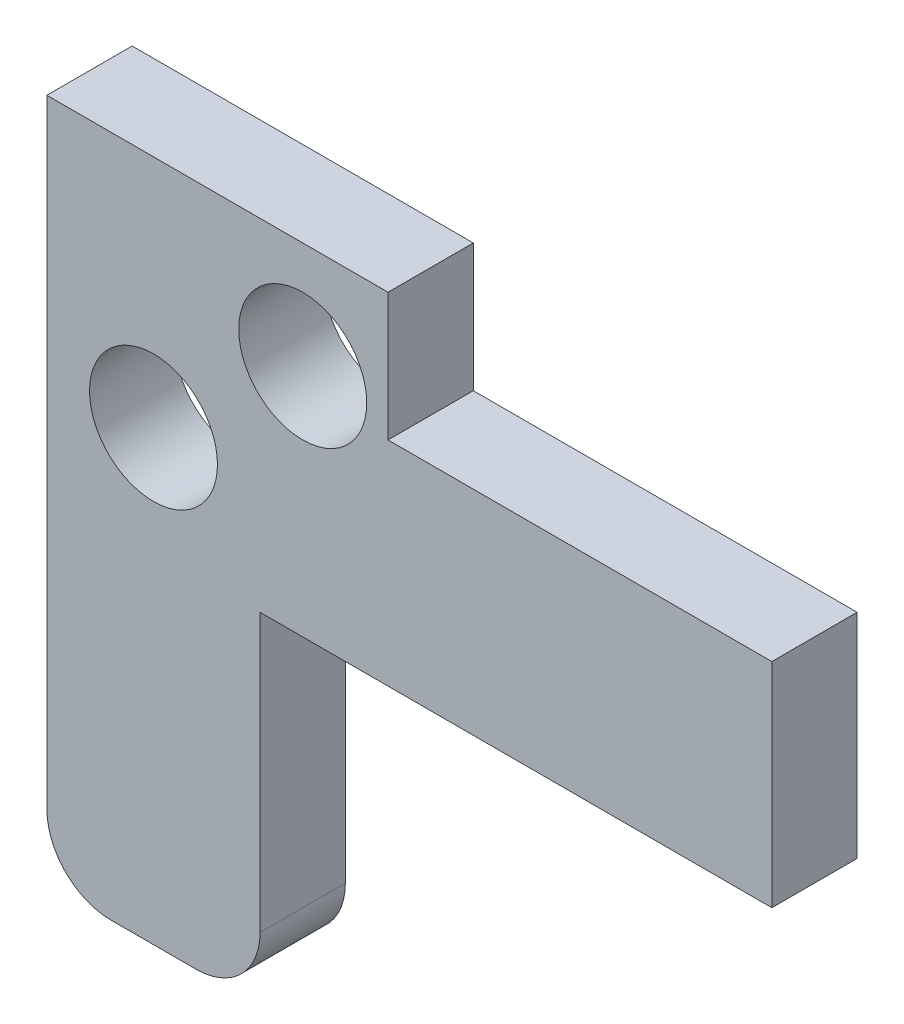
ISO-10303-21;
HEADER;
FILE_DESCRIPTION(('STEP AP214'),'2;1');
FILE_NAME('part.step','',(''),(''),'','','');
FILE_SCHEMA(('AUTOMOTIVE_DESIGN { 1 0 10303 214 1 1 1 1 }'));
ENDSEC;
DATA;
#1=APPLICATION_CONTEXT('core data for automotive mechanical design processes');
#2=APPLICATION_PROTOCOL_DEFINITION('international standard','automotive_design',2000,#1);
#3=PRODUCT_CONTEXT('',#1,'mechanical');
#4=PRODUCT('Part','Part','',(#3));
#5=PRODUCT_RELATED_PRODUCT_CATEGORY('part','',(#4));
#6=PRODUCT_DEFINITION_FORMATION('','',#4);
#7=PRODUCT_DEFINITION_CONTEXT('part definition',#1,'design');
#8=PRODUCT_DEFINITION('design','',#6,#7);
#9=PRODUCT_DEFINITION_SHAPE('','',#8);
#10=(LENGTH_UNIT() NAMED_UNIT(*) SI_UNIT(.MILLI.,.METRE.));
#11=(NAMED_UNIT(*) PLANE_ANGLE_UNIT() SI_UNIT($,.RADIAN.));
#12=(NAMED_UNIT(*) SI_UNIT($,.STERADIAN.) SOLID_ANGLE_UNIT());
#13=UNCERTAINTY_MEASURE_WITH_UNIT(LENGTH_MEASURE(1.E-05),#10,'distance_accuracy_value','');
#14=(GEOMETRIC_REPRESENTATION_CONTEXT(3) GLOBAL_UNCERTAINTY_ASSIGNED_CONTEXT((#13)) GLOBAL_UNIT_ASSIGNED_CONTEXT((#10,
#11,#12)) REPRESENTATION_CONTEXT('',''));
#15=CARTESIAN_POINT('',(0.,0.,0.));
#16=DIRECTION('',(0.,0.,1.));
#17=DIRECTION('',(1.,0.,0.));
#18=AXIS2_PLACEMENT_3D('',#15,#16,#17);
#19=CARTESIAN_POINT('',(0.,21.,2.));
#20=DIRECTION('',(0.,-1.,0.));
#21=DIRECTION('',(0.,0.,-1.));
#22=AXIS2_PLACEMENT_3D('',#19,#20,#21);
#23=PLANE('',#22);
#24=DIRECTION('',(0.,0.,-1.));
#25=VECTOR('',#24,1.);
#26=CARTESIAN_POINT('',(3.00000000000001,21.,0.));
#27=LINE('',#26,#25);
#28=CARTESIAN_POINT('',(3.00000000000001,21.,2.));
#29=VERTEX_POINT('',#28);
#30=CARTESIAN_POINT('',(3.00000000000001,21.,0.));
#31=VERTEX_POINT('',#30);
#32=EDGE_CURVE('E50',#29,#31,#27,.T.);
#33=ORIENTED_EDGE('',*,*,#32,.F.);
#34=DIRECTION('',(-1.,0.,0.));
#35=VECTOR('',#34,1.);
#36=CARTESIAN_POINT('',(0.,21.,2.));
#37=LINE('',#36,#35);
#38=CARTESIAN_POINT('',(12.,21.,2.));
#39=VERTEX_POINT('',#38);
#40=EDGE_CURVE('E122',#39,#29,#37,.T.);
#41=ORIENTED_EDGE('',*,*,#40,.F.);
#42=DIRECTION('',(0.,0.,-1.));
#43=VECTOR('',#42,1.);
#44=CARTESIAN_POINT('',(12.,21.,20.));
#45=LINE('',#44,#43);
#46=CARTESIAN_POINT('',(12.,21.,0.));
#47=VERTEX_POINT('',#46);
#48=EDGE_CURVE('E165',#39,#47,#45,.T.);
#49=ORIENTED_EDGE('',*,*,#48,.T.);
#50=DIRECTION('',(-1.,0.,0.));
#51=VECTOR('',#50,1.);
#52=CARTESIAN_POINT('',(0.,21.,0.));
#53=LINE('',#52,#51);
#54=EDGE_CURVE('E186',#47,#31,#53,.T.);
#55=ORIENTED_EDGE('',*,*,#54,.T.);
#56=EDGE_LOOP('',(#33,#41,#49,#55));
#57=FACE_BOUND('',#56,.T.);
#58=ADVANCED_FACE('F35',(#57),#23,.F.);
#59=CARTESIAN_POINT('',(0.,0.,2.));
#60=DIRECTION('',(-1.,0.,0.));
#61=DIRECTION('',(0.,0.,1.));
#62=AXIS2_PLACEMENT_3D('',#59,#60,#61);
#63=PLANE('',#62);
#64=DIRECTION('',(0.,1.,0.));
#65=VECTOR('',#64,1.);
#66=CARTESIAN_POINT('',(0.,0.,2.));
#67=LINE('',#66,#65);
#68=CARTESIAN_POINT('',(0.,9.5,2.));
#69=VERTEX_POINT('',#68);
#70=CARTESIAN_POINT('',(0.,16.,2.));
#71=VERTEX_POINT('',#70);
#72=EDGE_CURVE('E181',#69,#71,#67,.T.);
#73=ORIENTED_EDGE('',*,*,#72,.F.);
#74=DIRECTION('',(0.,0.,1.));
#75=VECTOR('',#74,1.);
#76=CARTESIAN_POINT('',(0.,9.5,2.));
#77=LINE('',#76,#75);
#78=CARTESIAN_POINT('',(0.,9.5,0.));
#79=VERTEX_POINT('',#78);
#80=EDGE_CURVE('E11',#69,#79,#77,.F.);
#81=ORIENTED_EDGE('',*,*,#80,.T.);
#82=DIRECTION('',(0.,1.,0.));
#83=VECTOR('',#82,1.);
#84=CARTESIAN_POINT('',(0.,0.,0.));
#85=LINE('',#84,#83);
#86=CARTESIAN_POINT('',(0.,16.,0.));
#87=VERTEX_POINT('',#86);
#88=EDGE_CURVE('E180',#79,#87,#85,.T.);
#89=ORIENTED_EDGE('',*,*,#88,.T.);
#90=DIRECTION('',(0.,0.,-1.));
#91=VECTOR('',#90,1.);
#92=CARTESIAN_POINT('',(0.,16.,0.));
#93=LINE('',#92,#91);
#94=EDGE_CURVE('E171',#71,#87,#93,.T.);
#95=ORIENTED_EDGE('',*,*,#94,.F.);
#96=EDGE_LOOP('',(#73,#81,#89,#95));
#97=FACE_BOUND('',#96,.T.);
#98=ADVANCED_FACE('F213',(#97),#63,.F.);
#99=CARTESIAN_POINT('',(-5.,0.,2.));
#100=DIRECTION('',(1.,0.,0.));
#101=DIRECTION('',(0.,0.,-1.));
#102=AXIS2_PLACEMENT_3D('',#99,#100,#101);
#103=PLANE('',#102);
#104=DIRECTION('',(0.,-1.,0.));
#105=VECTOR('',#104,1.);
#106=CARTESIAN_POINT('',(-5.,0.,0.));
#107=LINE('',#106,#105);
#108=CARTESIAN_POINT('',(-4.99999999999999,24.,0.));
#109=VERTEX_POINT('',#108);
#110=CARTESIAN_POINT('',(-5.,9.5,0.));
#111=VERTEX_POINT('',#110);
#112=EDGE_CURVE('E183',#109,#111,#107,.T.);
#113=ORIENTED_EDGE('',*,*,#112,.T.);
#114=DIRECTION('',(0.,0.,-1.));
#115=VECTOR('',#114,1.);
#116=CARTESIAN_POINT('',(-5.,9.5,2.));
#117=LINE('',#116,#115);
#118=CARTESIAN_POINT('',(-5.,9.5,2.));
#119=VERTEX_POINT('',#118);
#120=EDGE_CURVE('E119',#111,#119,#117,.F.);
#121=ORIENTED_EDGE('',*,*,#120,.T.);
#122=DIRECTION('',(0.,-1.,0.));
#123=VECTOR('',#122,1.);
#124=CARTESIAN_POINT('',(-5.,0.,2.));
#125=LINE('',#124,#123);
#126=CARTESIAN_POINT('',(-4.99999999999999,24.,2.));
#127=VERTEX_POINT('',#126);
#128=EDGE_CURVE('E112',#127,#119,#125,.T.);
#129=ORIENTED_EDGE('',*,*,#128,.F.);
#130=DIRECTION('',(0.,0.,1.));
#131=VECTOR('',#130,1.);
#132=CARTESIAN_POINT('',(-4.99999999999999,24.,0.));
#133=LINE('',#132,#131);
#134=EDGE_CURVE('E117',#109,#127,#133,.T.);
#135=ORIENTED_EDGE('',*,*,#134,.F.);
#136=EDGE_LOOP('',(#113,#121,#129,#135));
#137=FACE_BOUND('',#136,.T.);
#138=ADVANCED_FACE('F115',(#137),#103,.F.);
#139=CARTESIAN_POINT('',(0.,0.,2.));
#140=DIRECTION('',(0.,0.,1.));
#141=DIRECTION('',(1.,0.,0.));
#142=AXIS2_PLACEMENT_3D('',#139,#140,#141);
#143=PLANE('',#142);
#144=CARTESIAN_POINT('',(1.00000000000001,21.5,2.));
#145=DIRECTION('',(0.,0.,1.));
#146=DIRECTION('',(1.,0.,0.));
#147=AXIS2_PLACEMENT_3D('',#144,#145,#146);
#148=CIRCLE('',#147,1.5);
#149=CARTESIAN_POINT('',(2.50000000000001,21.5,2.));
#150=VERTEX_POINT('',#149);
#151=EDGE_CURVE('E139',#150,#150,#148,.T.);
#152=ORIENTED_EDGE('',*,*,#151,.F.);
#153=EDGE_LOOP('',(#152));
#154=FACE_BOUND('',#153,.T.);
#155=ORIENTED_EDGE('',*,*,#128,.T.);
#156=CARTESIAN_POINT('',(-3.5,9.5,2.));
#157=DIRECTION('',(0.,0.,1.));
#158=DIRECTION('',(1.,0.,0.));
#159=AXIS2_PLACEMENT_3D('',#156,#157,#158);
#160=CIRCLE('',#159,1.5);
#161=CARTESIAN_POINT('',(-3.5,8.,2.));
#162=VERTEX_POINT('',#161);
#163=EDGE_CURVE('E43',#119,#162,#160,.T.);
#164=ORIENTED_EDGE('',*,*,#163,.T.);
#165=DIRECTION('',(-1.,0.,0.));
#166=VECTOR('',#165,1.);
#167=CARTESIAN_POINT('',(0.,8.,2.));
#168=LINE('',#167,#166);
#169=CARTESIAN_POINT('',(-1.5,8.,2.));
#170=VERTEX_POINT('',#169);
#171=EDGE_CURVE('E150',#170,#162,#168,.T.);
#172=ORIENTED_EDGE('',*,*,#171,.F.);
#173=CARTESIAN_POINT('',(-1.5,9.5,2.));
#174=DIRECTION('',(0.,0.,1.));
#175=DIRECTION('',(1.,0.,0.));
#176=AXIS2_PLACEMENT_3D('',#173,#174,#175);
#177=CIRCLE('',#176,1.5);
#178=EDGE_CURVE('E58',#170,#69,#177,.T.);
#179=ORIENTED_EDGE('',*,*,#178,.T.);
#180=ORIENTED_EDGE('',*,*,#72,.T.);
#181=DIRECTION('',(-1.,0.,0.));
#182=VECTOR('',#181,1.);
#183=CARTESIAN_POINT('',(20.,16.,2.));
#184=LINE('',#183,#182);
#185=CARTESIAN_POINT('',(12.,16.,2.));
#186=VERTEX_POINT('',#185);
#187=EDGE_CURVE('E177',#186,#71,#184,.T.);
#188=ORIENTED_EDGE('',*,*,#187,.F.);
#189=DIRECTION('',(0.,-1.,0.));
#190=VECTOR('',#189,1.);
#191=CARTESIAN_POINT('',(12.,0.,2.));
#192=LINE('',#191,#190);
#193=EDGE_CURVE('E168',#39,#186,#192,.T.);
#194=ORIENTED_EDGE('',*,*,#193,.F.);
#195=ORIENTED_EDGE('',*,*,#40,.T.);
#196=DIRECTION('',(0.,-1.,0.));
#197=VECTOR('',#196,1.);
#198=CARTESIAN_POINT('',(3.00000000000001,24.,2.));
#199=LINE('',#198,#197);
#200=CARTESIAN_POINT('',(3.00000000000001,24.,2.));
#201=VERTEX_POINT('',#200);
#202=EDGE_CURVE('E129',#201,#29,#199,.T.);
#203=ORIENTED_EDGE('',*,*,#202,.F.);
#204=DIRECTION('',(1.,0.,0.));
#205=VECTOR('',#204,1.);
#206=CARTESIAN_POINT('',(-4.99999999999999,24.,2.));
#207=LINE('',#206,#205);
#208=EDGE_CURVE('E125',#127,#201,#207,.T.);
#209=ORIENTED_EDGE('',*,*,#208,.F.);
#210=EDGE_LOOP('',(#155,#164,#172,#179,#180,#188,#194,#195,#203,#209));
#211=FACE_BOUND('',#210,.T.);
#212=CARTESIAN_POINT('',(-2.5,18.5,2.));
#213=DIRECTION('',(0.,0.,1.));
#214=DIRECTION('',(1.,0.,0.));
#215=AXIS2_PLACEMENT_3D('',#212,#213,#214);
#216=CIRCLE('',#215,1.5);
#217=CARTESIAN_POINT('',(-1.,18.5,2.));
#218=VERTEX_POINT('',#217);
#219=EDGE_CURVE('E159',#218,#218,#216,.T.);
#220=ORIENTED_EDGE('',*,*,#219,.F.);
#221=EDGE_LOOP('',(#220));
#222=FACE_BOUND('',#221,.T.);
#223=ADVANCED_FACE('F126',(#154,#211,#222),#143,.T.);
#224=CARTESIAN_POINT('',(0.,0.,0.));
#225=DIRECTION('',(0.,0.,1.));
#226=DIRECTION('',(1.,0.,0.));
#227=AXIS2_PLACEMENT_3D('',#224,#225,#226);
#228=PLANE('',#227);
#229=CARTESIAN_POINT('',(1.00000000000001,21.5,0.));
#230=DIRECTION('',(0.,0.,-1.));
#231=DIRECTION('',(-1.,0.,0.));
#232=AXIS2_PLACEMENT_3D('',#229,#230,#231);
#233=CIRCLE('',#232,1.5);
#234=CARTESIAN_POINT('',(-0.49999999999999,21.5,0.));
#235=VERTEX_POINT('',#234);
#236=EDGE_CURVE('E269',#235,#235,#233,.T.);
#237=ORIENTED_EDGE('',*,*,#236,.F.);
#238=EDGE_LOOP('',(#237));
#239=FACE_BOUND('',#238,.T.);
#240=CARTESIAN_POINT('',(-2.5,18.5,0.));
#241=DIRECTION('',(0.,0.,-1.));
#242=DIRECTION('',(-1.,0.,0.));
#243=AXIS2_PLACEMENT_3D('',#240,#241,#242);
#244=CIRCLE('',#243,1.5);
#245=CARTESIAN_POINT('',(-4.,18.5,0.));
#246=VERTEX_POINT('',#245);
#247=EDGE_CURVE('E156',#246,#246,#244,.T.);
#248=ORIENTED_EDGE('',*,*,#247,.F.);
#249=EDGE_LOOP('',(#248));
#250=FACE_BOUND('',#249,.T.);
#251=DIRECTION('',(1.,0.,0.));
#252=VECTOR('',#251,1.);
#253=CARTESIAN_POINT('',(0.,8.,0.));
#254=LINE('',#253,#252);
#255=CARTESIAN_POINT('',(-3.5,8.,0.));
#256=VERTEX_POINT('',#255);
#257=CARTESIAN_POINT('',(-1.5,8.,0.));
#258=VERTEX_POINT('',#257);
#259=EDGE_CURVE('E153',#256,#258,#254,.T.);
#260=ORIENTED_EDGE('',*,*,#259,.F.);
#261=CARTESIAN_POINT('',(-3.5,9.5,0.));
#262=DIRECTION('',(0.,0.,1.));
#263=DIRECTION('',(1.,0.,0.));
#264=AXIS2_PLACEMENT_3D('',#261,#262,#263);
#265=CIRCLE('',#264,1.5);
#266=EDGE_CURVE('E196',#256,#111,#265,.F.);
#267=ORIENTED_EDGE('',*,*,#266,.T.);
#268=ORIENTED_EDGE('',*,*,#112,.F.);
#269=DIRECTION('',(-1.,0.,0.));
#270=VECTOR('',#269,1.);
#271=CARTESIAN_POINT('',(-4.99999999999999,24.,0.));
#272=LINE('',#271,#270);
#273=CARTESIAN_POINT('',(3.00000000000001,24.,0.));
#274=VERTEX_POINT('',#273);
#275=EDGE_CURVE('E137',#274,#109,#272,.T.);
#276=ORIENTED_EDGE('',*,*,#275,.F.);
#277=DIRECTION('',(0.,-1.,0.));
#278=VECTOR('',#277,1.);
#279=CARTESIAN_POINT('',(3.00000000000001,24.,0.));
#280=LINE('',#279,#278);
#281=EDGE_CURVE('E145',#274,#31,#280,.T.);
#282=ORIENTED_EDGE('',*,*,#281,.T.);
#283=ORIENTED_EDGE('',*,*,#54,.F.);
#284=DIRECTION('',(0.,1.,0.));
#285=VECTOR('',#284,1.);
#286=CARTESIAN_POINT('',(12.,16.,0.));
#287=LINE('',#286,#285);
#288=CARTESIAN_POINT('',(12.,16.,0.));
#289=VERTEX_POINT('',#288);
#290=EDGE_CURVE('E162',#289,#47,#287,.T.);
#291=ORIENTED_EDGE('',*,*,#290,.F.);
#292=DIRECTION('',(-1.,0.,0.));
#293=VECTOR('',#292,1.);
#294=CARTESIAN_POINT('',(20.,16.,0.));
#295=LINE('',#294,#293);
#296=EDGE_CURVE('E174',#289,#87,#295,.T.);
#297=ORIENTED_EDGE('',*,*,#296,.T.);
#298=ORIENTED_EDGE('',*,*,#88,.F.);
#299=CARTESIAN_POINT('',(-1.5,9.5,0.));
#300=DIRECTION('',(0.,0.,1.));
#301=DIRECTION('',(1.,0.,0.));
#302=AXIS2_PLACEMENT_3D('',#299,#300,#301);
#303=CIRCLE('',#302,1.5);
#304=EDGE_CURVE('E194',#79,#258,#303,.F.);
#305=ORIENTED_EDGE('',*,*,#304,.T.);
#306=EDGE_LOOP('',(#260,#267,#268,#276,#282,#283,#291,#297,#298,#305));
#307=FACE_BOUND('',#306,.T.);
#308=ADVANCED_FACE('F207',(#239,#250,#307),#228,.F.);
#309=CARTESIAN_POINT('',(20.,16.,0.));
#310=DIRECTION('',(0.,1.,0.));
#311=DIRECTION('',(0.,0.,1.));
#312=AXIS2_PLACEMENT_3D('',#309,#310,#311);
#313=PLANE('',#312);
#314=ORIENTED_EDGE('',*,*,#296,.F.);
#315=DIRECTION('',(0.,0.,-1.));
#316=VECTOR('',#315,1.);
#317=CARTESIAN_POINT('',(12.,16.,20.));
#318=LINE('',#317,#316);
#319=EDGE_CURVE('E164',#186,#289,#318,.T.);
#320=ORIENTED_EDGE('',*,*,#319,.F.);
#321=ORIENTED_EDGE('',*,*,#187,.T.);
#322=ORIENTED_EDGE('',*,*,#94,.T.);
#323=EDGE_LOOP('',(#314,#320,#321,#322));
#324=FACE_BOUND('',#323,.T.);
#325=ADVANCED_FACE('F220',(#324),#313,.F.);
#326=CARTESIAN_POINT('',(12.,16.,20.));
#327=DIRECTION('',(-1.,0.,0.));
#328=DIRECTION('',(0.,0.,1.));
#329=AXIS2_PLACEMENT_3D('',#326,#327,#328);
#330=PLANE('',#329);
#331=ORIENTED_EDGE('',*,*,#193,.T.);
#332=ORIENTED_EDGE('',*,*,#319,.T.);
#333=ORIENTED_EDGE('',*,*,#290,.T.);
#334=ORIENTED_EDGE('',*,*,#48,.F.);
#335=EDGE_LOOP('',(#331,#332,#333,#334));
#336=FACE_BOUND('',#335,.T.);
#337=ADVANCED_FACE('F252',(#336),#330,.F.);
#338=CARTESIAN_POINT('',(-2.5,18.5,20.));
#339=DIRECTION('',(0.,0.,-1.));
#340=DIRECTION('',(-1.,0.,0.));
#341=AXIS2_PLACEMENT_3D('',#338,#339,#340);
#342=CYLINDRICAL_SURFACE('',#341,1.5);
#343=ORIENTED_EDGE('',*,*,#219,.T.);
#344=EDGE_LOOP('',(#343));
#345=FACE_BOUND('',#344,.T.);
#346=ORIENTED_EDGE('',*,*,#247,.T.);
#347=EDGE_LOOP('',(#346));
#348=FACE_BOUND('',#347,.T.);
#349=ADVANCED_FACE('F248',(#345,#348),#342,.F.);
#350=CARTESIAN_POINT('',(0.,8.,0.));
#351=DIRECTION('',(0.,1.,0.));
#352=DIRECTION('',(-1.,0.,0.));
#353=AXIS2_PLACEMENT_3D('',#350,#351,#352);
#354=PLANE('',#353);
#355=ORIENTED_EDGE('',*,*,#171,.T.);
#356=DIRECTION('',(0.,0.,-1.));
#357=VECTOR('',#356,1.);
#358=CARTESIAN_POINT('',(-3.5,8.,0.));
#359=LINE('',#358,#357);
#360=EDGE_CURVE('E191',#162,#256,#359,.T.);
#361=ORIENTED_EDGE('',*,*,#360,.T.);
#362=ORIENTED_EDGE('',*,*,#259,.T.);
#363=DIRECTION('',(0.,0.,1.));
#364=VECTOR('',#363,1.);
#365=CARTESIAN_POINT('',(-1.5,8.,0.));
#366=LINE('',#365,#364);
#367=EDGE_CURVE('E121',#258,#170,#366,.T.);
#368=ORIENTED_EDGE('',*,*,#367,.T.);
#369=EDGE_LOOP('',(#355,#361,#362,#368));
#370=FACE_BOUND('',#369,.T.);
#371=ADVANCED_FACE('F202',(#370),#354,.F.);
#372=CARTESIAN_POINT('',(-3.5,9.5,0.));
#373=DIRECTION('',(0.,0.,-1.));
#374=DIRECTION('',(-1.,0.,0.));
#375=AXIS2_PLACEMENT_3D('',#372,#373,#374);
#376=CYLINDRICAL_SURFACE('',#375,1.5);
#377=ORIENTED_EDGE('',*,*,#163,.F.);
#378=ORIENTED_EDGE('',*,*,#120,.F.);
#379=ORIENTED_EDGE('',*,*,#266,.F.);
#380=ORIENTED_EDGE('',*,*,#360,.F.);
#381=EDGE_LOOP('',(#377,#378,#379,#380));
#382=FACE_BOUND('',#381,.T.);
#383=ADVANCED_FACE('F205',(#382),#376,.T.);
#384=CARTESIAN_POINT('',(-1.5,9.5,0.));
#385=DIRECTION('',(0.,0.,1.));
#386=DIRECTION('',(1.,0.,0.));
#387=AXIS2_PLACEMENT_3D('',#384,#385,#386);
#388=CYLINDRICAL_SURFACE('',#387,1.5);
#389=ORIENTED_EDGE('',*,*,#304,.F.);
#390=ORIENTED_EDGE('',*,*,#80,.F.);
#391=ORIENTED_EDGE('',*,*,#178,.F.);
#392=ORIENTED_EDGE('',*,*,#367,.F.);
#393=EDGE_LOOP('',(#389,#390,#391,#392));
#394=FACE_BOUND('',#393,.T.);
#395=ADVANCED_FACE('F37',(#394),#388,.T.);
#396=CARTESIAN_POINT('',(3.00000000000001,24.,0.));
#397=DIRECTION('',(-1.,0.,0.));
#398=DIRECTION('',(0.,-1.,0.));
#399=AXIS2_PLACEMENT_3D('',#396,#397,#398);
#400=PLANE('',#399);
#401=ORIENTED_EDGE('',*,*,#32,.T.);
#402=ORIENTED_EDGE('',*,*,#281,.F.);
#403=DIRECTION('',(0.,0.,-1.));
#404=VECTOR('',#403,1.);
#405=CARTESIAN_POINT('',(3.00000000000001,24.,0.));
#406=LINE('',#405,#404);
#407=EDGE_CURVE('E132',#201,#274,#406,.T.);
#408=ORIENTED_EDGE('',*,*,#407,.F.);
#409=ORIENTED_EDGE('',*,*,#202,.T.);
#410=EDGE_LOOP('',(#401,#402,#408,#409));
#411=FACE_BOUND('',#410,.T.);
#412=ADVANCED_FACE('F226',(#411),#400,.F.);
#413=CARTESIAN_POINT('',(0.,24.,0.));
#414=DIRECTION('',(0.,1.,0.));
#415=DIRECTION('',(-1.,0.,0.));
#416=AXIS2_PLACEMENT_3D('',#413,#414,#415);
#417=PLANE('',#416);
#418=ORIENTED_EDGE('',*,*,#134,.T.);
#419=ORIENTED_EDGE('',*,*,#208,.T.);
#420=ORIENTED_EDGE('',*,*,#407,.T.);
#421=ORIENTED_EDGE('',*,*,#275,.T.);
#422=EDGE_LOOP('',(#418,#419,#420,#421));
#423=FACE_BOUND('',#422,.T.);
#424=ADVANCED_FACE('F135',(#423),#417,.T.);
#425=CARTESIAN_POINT('',(1.00000000000001,21.5,5.));
#426=DIRECTION('',(0.,0.,-1.));
#427=DIRECTION('',(-1.,0.,0.));
#428=AXIS2_PLACEMENT_3D('',#425,#426,#427);
#429=CYLINDRICAL_SURFACE('',#428,1.5);
#430=ORIENTED_EDGE('',*,*,#151,.T.);
#431=EDGE_LOOP('',(#430));
#432=FACE_BOUND('',#431,.T.);
#433=ORIENTED_EDGE('',*,*,#236,.T.);
#434=EDGE_LOOP('',(#433));
#435=FACE_BOUND('',#434,.T.);
#436=ADVANCED_FACE('F233',(#432,#435),#429,.F.);
#437=CLOSED_SHELL('',(#58,#98,#138,#223,#308,#325,#337,#349,#371,#383,#395,#412,#424,#436));
#438=MANIFOLD_SOLID_BREP('B2',#437);
#439=ADVANCED_BREP_SHAPE_REPRESENTATION('',(#18,#438),#14);
#440=SHAPE_DEFINITION_REPRESENTATION(#9,#439);
ENDSEC;
END-ISO-10303-21;
